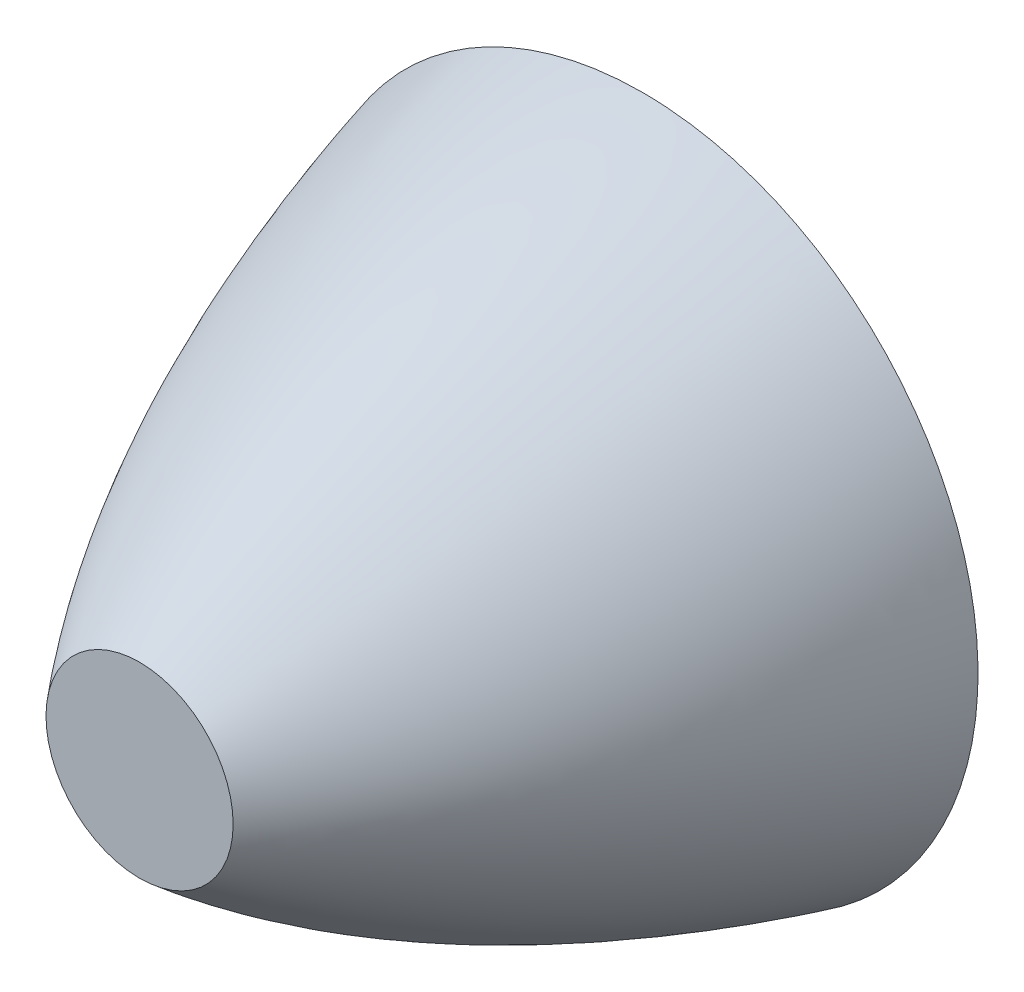
ISO-10303-21;
HEADER;
FILE_DESCRIPTION(('STEP AP214'),'2;1');
FILE_NAME('part.step','',(''),(''),'','','');
FILE_SCHEMA(('AUTOMOTIVE_DESIGN { 1 0 10303 214 1 1 1 1 }'));
ENDSEC;
DATA;
#1=APPLICATION_CONTEXT('core data for automotive mechanical design processes');
#2=APPLICATION_PROTOCOL_DEFINITION('international standard','automotive_design',2000,#1);
#3=PRODUCT_CONTEXT('',#1,'mechanical');
#4=PRODUCT('Part','Part','',(#3));
#5=PRODUCT_RELATED_PRODUCT_CATEGORY('part','',(#4));
#6=PRODUCT_DEFINITION_FORMATION('','',#4);
#7=PRODUCT_DEFINITION_CONTEXT('part definition',#1,'design');
#8=PRODUCT_DEFINITION('design','',#6,#7);
#9=PRODUCT_DEFINITION_SHAPE('','',#8);
#10=(LENGTH_UNIT() NAMED_UNIT(*) SI_UNIT(.MILLI.,.METRE.));
#11=(NAMED_UNIT(*) PLANE_ANGLE_UNIT() SI_UNIT($,.RADIAN.));
#12=(NAMED_UNIT(*) SI_UNIT($,.STERADIAN.) SOLID_ANGLE_UNIT());
#13=UNCERTAINTY_MEASURE_WITH_UNIT(LENGTH_MEASURE(1.E-05),#10,'distance_accuracy_value','');
#14=(GEOMETRIC_REPRESENTATION_CONTEXT(3) GLOBAL_UNCERTAINTY_ASSIGNED_CONTEXT((#13)) GLOBAL_UNIT_ASSIGNED_CONTEXT((#10,
#11,#12)) REPRESENTATION_CONTEXT('',''));
#15=CARTESIAN_POINT('',(0.,0.,0.));
#16=DIRECTION('',(0.,0.,1.));
#17=DIRECTION('',(1.,0.,0.));
#18=AXIS2_PLACEMENT_3D('',#15,#16,#17);
#19=CARTESIAN_POINT('',(0.,0.,75.));
#20=DIRECTION('',(0.,0.,1.));
#21=DIRECTION('',(1.,0.,0.));
#22=AXIS2_PLACEMENT_3D('',#19,#20,#21);
#23=PLANE('',#22);
#24=CARTESIAN_POINT('',(0.,13.95,75.));
#25=CARTESIAN_POINT('',(0.91302535900883,13.95,75.));
#26=CARTESIAN_POINT('',(2.73892759735863,13.7686142272891,75.));
#27=CARTESIAN_POINT('',(5.37335159956246,12.9725849281543,75.));
#28=CARTESIAN_POINT('',(7.79936233012814,11.6728116670155,75.));
#29=CARTESIAN_POINT('',(9.92862671172328,9.92862671172327,75.));
#30=CARTESIAN_POINT('',(11.6728116670155,7.79936233012814,75.));
#31=CARTESIAN_POINT('',(12.9725849281543,5.37335159956247,75.));
#32=CARTESIAN_POINT('',(13.7686142272891,2.73892759735863,75.));
#33=CARTESIAN_POINT('',(13.95,0.913025359008829,75.));
#34=CARTESIAN_POINT('',(13.95,-0.913025359008829,75.));
#35=CARTESIAN_POINT('',(13.7686142272891,-2.73892759735863,75.));
#36=CARTESIAN_POINT('',(12.9725849281543,-5.37335159956246,75.));
#37=CARTESIAN_POINT('',(11.6728116670155,-7.79936233012814,75.));
#38=CARTESIAN_POINT('',(9.92862671172328,-9.92862671172328,75.));
#39=CARTESIAN_POINT('',(7.79936233012814,-11.6728116670155,75.));
#40=CARTESIAN_POINT('',(5.37335159956247,-12.9725849281543,75.));
#41=CARTESIAN_POINT('',(2.73892759735863,-13.7686142272891,75.));
#42=CARTESIAN_POINT('',(0.913025359008826,-13.95,75.));
#43=CARTESIAN_POINT('',(-0.913025359008832,-13.95,75.));
#44=CARTESIAN_POINT('',(-2.73892759735863,-13.7686142272891,75.));
#45=CARTESIAN_POINT('',(-5.37335159956246,-12.9725849281543,75.));
#46=CARTESIAN_POINT('',(-7.79936233012814,-11.6728116670155,75.));
#47=CARTESIAN_POINT('',(-9.92862671172328,-9.92862671172328,75.));
#48=CARTESIAN_POINT('',(-11.6728116670155,-7.79936233012814,75.));
#49=CARTESIAN_POINT('',(-12.9725849281543,-5.37335159956246,75.));
#50=CARTESIAN_POINT('',(-13.7686142272891,-2.73892759735863,75.));
#51=CARTESIAN_POINT('',(-13.95,-0.913025359008827,75.));
#52=CARTESIAN_POINT('',(-13.95,0.913025359008831,75.));
#53=CARTESIAN_POINT('',(-13.7686142272891,2.73892759735863,75.));
#54=CARTESIAN_POINT('',(-12.9725849281543,5.37335159956247,75.));
#55=CARTESIAN_POINT('',(-11.6728116670155,7.79936233012814,75.));
#56=CARTESIAN_POINT('',(-9.92862671172327,9.92862671172327,75.));
#57=CARTESIAN_POINT('',(-7.79936233012814,11.6728116670155,75.));
#58=CARTESIAN_POINT('',(-5.37335159956247,12.9725849281543,75.));
#59=CARTESIAN_POINT('',(-2.73892759735864,13.7686142272891,75.));
#60=CARTESIAN_POINT('',(-0.913025359008828,13.95,75.));
#61=CARTESIAN_POINT('',(0.,13.95,75.));
#62=B_SPLINE_CURVE_WITH_KNOTS('',3,(#24,#25,#26,#27,#28,#29,#30,#31,#32,#33,#34,#35,#36,#37,#38,
#39,#40,#41,#42,#43,#44,#45,#46,#47,#48,#49,#50,#51,#52,#53,#54,#55,#56,#57,#58,#59,#60,#61),
.UNSPECIFIED.,.T.,.F.,(4,1,1,1,1,1,1,1,2,1,1,1,1,1,1,1,2,1,1,1,1,1,1,1,2,1,1,1,1,1,1,1,4),(0.,
0.03125,0.0625,0.09375,0.125,0.15625,0.1875,0.21875,0.25,0.28125,0.3125,0.34375,0.375,0.40625,
0.4375,0.46875,0.5,0.53125,0.5625,0.59375,0.625,0.65625,0.6875,0.71875,0.75,0.78125,0.8125,
0.84375,0.875,0.90625,0.9375,0.96875,1.),.UNSPECIFIED.);
#63=CARTESIAN_POINT('',(0.,13.95,75.));
#64=VERTEX_POINT('',#63);
#65=EDGE_CURVE('E9',#64,#64,#62,.F.);
#66=ORIENTED_EDGE('',*,*,#65,.T.);
#67=EDGE_LOOP('',(#66));
#68=FACE_BOUND('',#67,.T.);
#69=ADVANCED_FACE('F14',(#68),#23,.T.);
#70=CARTESIAN_POINT('',(0.,0.,0.));
#71=DIRECTION('',(0.,0.,1.));
#72=DIRECTION('',(1.,0.,0.));
#73=AXIS2_PLACEMENT_3D('',#70,#71,#72);
#74=PLANE('',#73);
#75=CARTESIAN_POINT('',(0.,50.,0.));
#76=CARTESIAN_POINT('',(-3.27249232619652,50.,0.));
#77=CARTESIAN_POINT('',(-9.81739881748334,49.3555679668692,0.));
#78=CARTESIAN_POINT('',(-19.2575569405846,46.4918078630419,0.));
#79=CARTESIAN_POINT('',(-27.9576361956054,41.8415808724706,0.));
#80=CARTESIAN_POINT('',(-35.5833109403082,35.5833109403082,0.));
#81=CARTESIAN_POINT('',(-41.8415808724706,27.9576361956053,0.));
#82=CARTESIAN_POINT('',(-46.491807863042,19.2575569405848,0.));
#83=CARTESIAN_POINT('',(-49.3555679668691,9.8173988174832,0.));
#84=CARTESIAN_POINT('',(-50.,3.27249232619653,0.));
#85=CARTESIAN_POINT('',(-50.,-3.27249232619652,0.));
#86=CARTESIAN_POINT('',(-49.3555679668692,-9.81739881748326,0.));
#87=CARTESIAN_POINT('',(-46.491807863042,-19.2575569405846,0.));
#88=CARTESIAN_POINT('',(-41.8415808724706,-27.9576361956054,0.));
#89=CARTESIAN_POINT('',(-35.5833109403083,-35.5833109403082,0.));
#90=CARTESIAN_POINT('',(-27.9576361956053,-41.8415808724706,0.));
#91=CARTESIAN_POINT('',(-19.2575569405848,-46.4918078630421,0.));
#92=CARTESIAN_POINT('',(-9.81739881748319,-49.355567966869,0.));
#93=CARTESIAN_POINT('',(-3.27249232619653,-50.,0.));
#94=CARTESIAN_POINT('',(3.27249232619651,-50.,0.));
#95=CARTESIAN_POINT('',(9.81739881748326,-49.3555679668691,0.));
#96=CARTESIAN_POINT('',(19.2575569405847,-46.4918078630421,0.));
#97=CARTESIAN_POINT('',(27.9576361956053,-41.8415808724706,0.));
#98=CARTESIAN_POINT('',(35.5833109403083,-35.5833109403082,0.));
#99=CARTESIAN_POINT('',(41.8415808724705,-27.9576361956054,0.));
#100=CARTESIAN_POINT('',(46.4918078630421,-19.2575569405848,0.));
#101=CARTESIAN_POINT('',(49.355567966869,-9.8173988174832,0.));
#102=CARTESIAN_POINT('',(50.,-3.27249232619652,0.));
#103=CARTESIAN_POINT('',(50.,3.27249232619652,0.));
#104=CARTESIAN_POINT('',(49.3555679668692,9.8173988174833,0.));
#105=CARTESIAN_POINT('',(46.491807863042,19.2575569405846,0.));
#106=CARTESIAN_POINT('',(41.8415808724707,27.9576361956054,0.));
#107=CARTESIAN_POINT('',(35.5833109403082,35.5833109403083,0.));
#108=CARTESIAN_POINT('',(27.9576361956054,41.8415808724706,0.));
#109=CARTESIAN_POINT('',(19.2575569405847,46.4918078630421,0.));
#110=CARTESIAN_POINT('',(9.81739881748319,49.355567966869,0.));
#111=CARTESIAN_POINT('',(3.27249232619653,50.,0.));
#112=CARTESIAN_POINT('',(0.,50.,0.));
#113=B_SPLINE_CURVE_WITH_KNOTS('',3,(#75,#76,#77,#78,#79,#80,#81,#82,#83,#84,#85,#86,#87,#88,
#89,#90,#91,#92,#93,#94,#95,#96,#97,#98,#99,#100,#101,#102,#103,#104,#105,#106,#107,#108,#109,
#110,#111,#112),.UNSPECIFIED.,.T.,.F.,(4,1,1,1,1,1,1,1,2,1,1,1,1,1,1,1,2,1,1,1,1,1,1,1,2,1,1,1,
1,1,1,1,4),(0.,0.03125,0.0625,0.09375,0.125,0.15625,0.1875,0.21875,0.25,0.28125,0.3125,0.34375,
0.375,0.40625,0.4375,0.46875,0.5,0.53125,0.5625,0.59375,0.625,0.65625,0.6875,0.71875,0.75,
0.78125,0.8125,0.84375,0.875,0.90625,0.9375,0.96875,1.),.UNSPECIFIED.);
#114=CARTESIAN_POINT('',(0.,50.,0.));
#115=VERTEX_POINT('',#114);
#116=EDGE_CURVE('E23',#115,#115,#113,.T.);
#117=ORIENTED_EDGE('',*,*,#116,.F.);
#118=EDGE_LOOP('',(#117));
#119=FACE_BOUND('',#118,.T.);
#120=ADVANCED_FACE('F49',(#119),#74,.F.);
#121=CARTESIAN_POINT('',(0.,50.,0.));
#122=CARTESIAN_POINT('',(0.,44.4643359863118,28.068168317841));
#123=CARTESIAN_POINT('',(0.,32.4476693196452,53.0681683178409));
#124=CARTESIAN_POINT('',(0.,13.95,75.));
#125=CARTESIAN_POINT('',(-3.27249232619652,50.,0.));
#126=CARTESIAN_POINT('',(-2.48600333713396,44.4643359863118,28.068168317841));
#127=CARTESIAN_POINT('',(-1.6995143480714,32.4476693196452,53.0681683178409));
#128=CARTESIAN_POINT('',(-0.913025359008828,13.95,75.));
#129=CARTESIAN_POINT('',(-9.81739881748334,49.3555679668692,0.));
#130=CARTESIAN_POINT('',(-7.65130661791002,43.7717213737487,28.0635445711323));
#131=CARTESIAN_POINT('',(-5.29181621120178,31.9094034605554,53.0635445711323));
#132=CARTESIAN_POINT('',(-2.73892759735864,13.7686142272891,75.));
#133=CARTESIAN_POINT('',(-19.2575569405846,46.4918078630419,0.));
#134=CARTESIAN_POINT('',(-15.5481299774681,40.8377123730898,28.0462055209748));
#135=CARTESIAN_POINT('',(-10.9200615304607,29.6646380614605,53.0462055209748));
#136=CARTESIAN_POINT('',(-5.37335159956247,12.9725849281543,75.));
#137=CARTESIAN_POINT('',(-27.9576361956054,41.8415808724706,0.));
#138=CARTESIAN_POINT('',(-23.1721936451288,36.2410137945749,28.0219308507543));
#139=CARTESIAN_POINT('',(-16.452769023303,26.1847573927566,53.0219308507544));
#140=CARTESIAN_POINT('',(-7.79936233012814,11.6728116670155,75.));
#141=CARTESIAN_POINT('',(-35.5833109403082,35.5833109403082,0.));
#142=CARTESIAN_POINT('',(-30.1261208449384,30.2722508572692,27.9941883705023));
#143=CARTESIAN_POINT('',(-21.5745594354101,21.7206894477408,52.9941883705024));
#144=CARTESIAN_POINT('',(-9.92862671172327,9.92862671172327,75.));
#145=CARTESIAN_POINT('',(-41.8415808724706,27.9576361956053,0.));
#146=CARTESIAN_POINT('',(-36.0400850276203,23.2635249028354,27.9664458902504));
#147=CARTESIAN_POINT('',(-25.9838286258019,16.5441002810097,52.9664458902504));
#148=CARTESIAN_POINT('',(-11.6728116670155,7.79936233012814,75.));
#149=CARTESIAN_POINT('',(-46.491807863042,19.2575569405848,0.));
#150=CARTESIAN_POINT('',(-40.588834695839,15.5915123248788,27.94217122003));
#151=CARTESIAN_POINT('',(-29.4157603842098,10.9634438778714,52.94217122003));
#152=CARTESIAN_POINT('',(-12.9725849281543,5.37335159956247,75.));
#153=CARTESIAN_POINT('',(-49.3555679668691,9.8173988174832,0.));
#154=CARTESIAN_POINT('',(-43.4885944748579,7.66043974368059,27.9248321698725));
#155=CARTESIAN_POINT('',(-31.6262765616646,5.3009493369724,52.9248321698725));
#156=CARTESIAN_POINT('',(-13.7686142272891,2.73892759735863,75.));
#157=CARTESIAN_POINT('',(-50.,3.27249232619653,0.));
#158=CARTESIAN_POINT('',(-44.1720759616504,2.48600333713396,27.9202084231638));
#159=CARTESIAN_POINT('',(-32.1554092949837,1.6995143480714,52.9202084231638));
#160=CARTESIAN_POINT('',(-13.95,0.913025359008831,75.));
#161=CARTESIAN_POINT('',(-50.,-3.27249232619652,0.));
#162=CARTESIAN_POINT('',(-44.1720759616504,-2.48600333713396,27.9202084231638));
#163=CARTESIAN_POINT('',(-32.1554092949837,-1.69951434807139,52.9202084231638));
#164=CARTESIAN_POINT('',(-13.95,-0.913025359008827,75.));
#165=CARTESIAN_POINT('',(-49.3555679668692,-9.81739881748326,0.));
#166=CARTESIAN_POINT('',(-43.4885944748579,-7.66043974368063,27.9248321698725));
#167=CARTESIAN_POINT('',(-31.6262765616646,-5.30094933697242,52.9248321698725));
#168=CARTESIAN_POINT('',(-13.7686142272891,-2.73892759735863,75.));
#169=CARTESIAN_POINT('',(-46.491807863042,-19.2575569405846,0.));
#170=CARTESIAN_POINT('',(-40.588834695839,-15.5915123248788,27.94217122003));
#171=CARTESIAN_POINT('',(-29.4157603842098,-10.9634438778714,52.94217122003));
#172=CARTESIAN_POINT('',(-12.9725849281543,-5.37335159956246,75.));
#173=CARTESIAN_POINT('',(-41.8415808724706,-27.9576361956054,0.));
#174=CARTESIAN_POINT('',(-36.0400850276202,-23.2635249028354,27.9664458902504));
#175=CARTESIAN_POINT('',(-25.9838286258019,-16.5441002810097,52.9664458902504));
#176=CARTESIAN_POINT('',(-11.6728116670155,-7.79936233012814,75.));
#177=CARTESIAN_POINT('',(-35.5833109403083,-35.5833109403082,0.));
#178=CARTESIAN_POINT('',(-30.1261208449385,-30.2722508572692,27.9941883705024));
#179=CARTESIAN_POINT('',(-21.5745594354101,-21.7206894477408,52.9941883705024));
#180=CARTESIAN_POINT('',(-9.92862671172328,-9.92862671172328,75.));
#181=CARTESIAN_POINT('',(-27.9576361956053,-41.8415808724706,0.));
#182=CARTESIAN_POINT('',(-23.1721936451287,-36.2410137945749,28.0219308507543));
#183=CARTESIAN_POINT('',(-16.452769023303,-26.1847573927566,53.0219308507544));
#184=CARTESIAN_POINT('',(-7.79936233012814,-11.6728116670155,75.));
#185=CARTESIAN_POINT('',(-19.2575569405848,-46.4918078630421,0.));
#186=CARTESIAN_POINT('',(-15.5481299774681,-40.8377123730899,28.0462055209748));
#187=CARTESIAN_POINT('',(-10.9200615304607,-29.6646380614605,53.0462055209748));
#188=CARTESIAN_POINT('',(-5.37335159956246,-12.9725849281543,75.));
#189=CARTESIAN_POINT('',(-9.81739881748319,-49.355567966869,0.));
#190=CARTESIAN_POINT('',(-7.65130661790991,-43.7717213737486,28.0635445711323));
#191=CARTESIAN_POINT('',(-5.29181621120172,-31.9094034605554,53.0635445711323));
#192=CARTESIAN_POINT('',(-2.73892759735863,-13.7686142272891,75.));
#193=CARTESIAN_POINT('',(-3.27249232619653,-50.,0.));
#194=CARTESIAN_POINT('',(-2.48600333713396,-44.4643359863118,28.068168317841));
#195=CARTESIAN_POINT('',(-1.6995143480714,-32.4476693196452,53.0681683178409));
#196=CARTESIAN_POINT('',(-0.913025359008832,-13.95,75.));
#197=CARTESIAN_POINT('',(3.27249232619651,-50.,0.));
#198=CARTESIAN_POINT('',(2.48600333713396,-44.4643359863118,28.068168317841));
#199=CARTESIAN_POINT('',(1.6995143480714,-32.4476693196452,53.0681683178409));
#200=CARTESIAN_POINT('',(0.913025359008826,-13.95,75.));
#201=CARTESIAN_POINT('',(9.81739881748326,-49.3555679668691,0.));
#202=CARTESIAN_POINT('',(7.65130661790997,-43.7717213737487,28.0635445711323));
#203=CARTESIAN_POINT('',(5.29181621120176,-31.9094034605554,53.0635445711323));
#204=CARTESIAN_POINT('',(2.73892759735863,-13.7686142272891,75.));
#205=CARTESIAN_POINT('',(19.2575569405847,-46.4918078630421,0.));
#206=CARTESIAN_POINT('',(15.5481299774681,-40.8377123730898,28.0462055209748));
#207=CARTESIAN_POINT('',(10.9200615304607,-29.6646380614605,53.0462055209748));
#208=CARTESIAN_POINT('',(5.37335159956247,-12.9725849281543,75.));
#209=CARTESIAN_POINT('',(27.9576361956053,-41.8415808724706,0.));
#210=CARTESIAN_POINT('',(23.1721936451287,-36.2410137945749,28.0219308507543));
#211=CARTESIAN_POINT('',(16.452769023303,-26.1847573927566,53.0219308507544));
#212=CARTESIAN_POINT('',(7.79936233012814,-11.6728116670155,75.));
#213=CARTESIAN_POINT('',(35.5833109403083,-35.5833109403082,0.));
#214=CARTESIAN_POINT('',(30.1261208449385,-30.2722508572692,27.9941883705024));
#215=CARTESIAN_POINT('',(21.5745594354102,-21.7206894477408,52.9941883705024));
#216=CARTESIAN_POINT('',(9.92862671172328,-9.92862671172328,75.));
#217=CARTESIAN_POINT('',(41.8415808724705,-27.9576361956054,0.));
#218=CARTESIAN_POINT('',(36.0400850276202,-23.2635249028354,27.9664458902504));
#219=CARTESIAN_POINT('',(25.9838286258018,-16.5441002810097,52.9664458902504));
#220=CARTESIAN_POINT('',(11.6728116670155,-7.79936233012814,75.));
#221=CARTESIAN_POINT('',(46.4918078630421,-19.2575569405848,0.));
#222=CARTESIAN_POINT('',(40.5888346958391,-15.5915123248788,27.94217122003));
#223=CARTESIAN_POINT('',(29.4157603842099,-10.9634438778714,52.94217122003));
#224=CARTESIAN_POINT('',(12.9725849281543,-5.37335159956246,75.));
#225=CARTESIAN_POINT('',(49.355567966869,-9.8173988174832,0.));
#226=CARTESIAN_POINT('',(43.4885944748579,-7.66043974368059,27.9248321698725));
#227=CARTESIAN_POINT('',(31.6262765616646,-5.3009493369724,52.9248321698725));
#228=CARTESIAN_POINT('',(13.7686142272891,-2.73892759735863,75.));
#229=CARTESIAN_POINT('',(50.,-3.27249232619652,0.));
#230=CARTESIAN_POINT('',(44.1720759616504,-2.48600333713396,27.9202084231638));
#231=CARTESIAN_POINT('',(32.1554092949837,-1.6995143480714,52.9202084231638));
#232=CARTESIAN_POINT('',(13.95,-0.913025359008829,75.));
#233=CARTESIAN_POINT('',(50.,3.27249232619652,0.));
#234=CARTESIAN_POINT('',(44.1720759616504,2.48600333713396,27.9202084231638));
#235=CARTESIAN_POINT('',(32.1554092949837,1.6995143480714,52.9202084231638));
#236=CARTESIAN_POINT('',(13.95,0.913025359008829,75.));
#237=CARTESIAN_POINT('',(49.3555679668692,9.8173988174833,0.));
#238=CARTESIAN_POINT('',(43.4885944748579,7.66043974368066,27.9248321698725));
#239=CARTESIAN_POINT('',(31.6262765616646,5.30094933697244,52.9248321698725));
#240=CARTESIAN_POINT('',(13.7686142272891,2.73892759735863,75.));
#241=CARTESIAN_POINT('',(46.491807863042,19.2575569405846,0.));
#242=CARTESIAN_POINT('',(40.588834695839,15.5915123248788,27.94217122003));
#243=CARTESIAN_POINT('',(29.4157603842098,10.9634438778714,52.94217122003));
#244=CARTESIAN_POINT('',(12.9725849281543,5.37335159956247,75.));
#245=CARTESIAN_POINT('',(41.8415808724707,27.9576361956054,0.));
#246=CARTESIAN_POINT('',(36.0400850276203,23.2635249028354,27.9664458902504));
#247=CARTESIAN_POINT('',(25.9838286258019,16.5441002810097,52.9664458902504));
#248=CARTESIAN_POINT('',(11.6728116670155,7.79936233012814,75.));
#249=CARTESIAN_POINT('',(35.5833109403082,35.5833109403083,0.));
#250=CARTESIAN_POINT('',(30.1261208449384,30.2722508572692,27.9941883705024));
#251=CARTESIAN_POINT('',(21.5745594354101,21.7206894477409,52.9941883705024));
#252=CARTESIAN_POINT('',(9.92862671172328,9.92862671172327,75.));
#253=CARTESIAN_POINT('',(27.9576361956054,41.8415808724706,0.));
#254=CARTESIAN_POINT('',(23.1721936451287,36.2410137945749,28.0219308507543));
#255=CARTESIAN_POINT('',(16.452769023303,26.1847573927566,53.0219308507544));
#256=CARTESIAN_POINT('',(7.79936233012814,11.6728116670155,75.));
#257=CARTESIAN_POINT('',(19.2575569405847,46.4918078630421,0.));
#258=CARTESIAN_POINT('',(15.5481299774681,40.8377123730899,28.0462055209748));
#259=CARTESIAN_POINT('',(10.9200615304607,29.6646380614606,53.0462055209748));
#260=CARTESIAN_POINT('',(5.37335159956246,12.9725849281543,75.));
#261=CARTESIAN_POINT('',(9.81739881748319,49.355567966869,0.));
#262=CARTESIAN_POINT('',(7.65130661790991,43.7717213737486,28.0635445711323));
#263=CARTESIAN_POINT('',(5.29181621120172,31.9094034605554,53.0635445711323));
#264=CARTESIAN_POINT('',(2.73892759735863,13.7686142272891,75.));
#265=CARTESIAN_POINT('',(3.27249232619653,50.,0.));
#266=CARTESIAN_POINT('',(2.48600333713396,44.4643359863118,28.068168317841));
#267=CARTESIAN_POINT('',(1.6995143480714,32.4476693196452,53.0681683178409));
#268=CARTESIAN_POINT('',(0.91302535900883,13.95,75.));
#269=CARTESIAN_POINT('',(0.,50.,0.));
#270=CARTESIAN_POINT('',(0.,44.4643359863118,28.068168317841));
#271=CARTESIAN_POINT('',(0.,32.4476693196452,53.0681683178409));
#272=CARTESIAN_POINT('',(0.,13.95,75.));
#273=B_SPLINE_SURFACE_WITH_KNOTS('',3,3,((#121,#122,#123,#124),(#125,#126,#127,#128),(#129,#130,
#131,#132),(#133,#134,#135,#136),(#137,#138,#139,#140),(#141,#142,#143,#144),(#145,#146,#147,
#148),(#149,#150,#151,#152),(#153,#154,#155,#156),(#157,#158,#159,#160),(#161,#162,#163,#164),
(#165,#166,#167,#168),(#169,#170,#171,#172),(#173,#174,#175,#176),(#177,#178,#179,#180),(#181,
#182,#183,#184),(#185,#186,#187,#188),(#189,#190,#191,#192),(#193,#194,#195,#196),(#197,#198,
#199,#200),(#201,#202,#203,#204),(#205,#206,#207,#208),(#209,#210,#211,#212),(#213,#214,#215,
#216),(#217,#218,#219,#220),(#221,#222,#223,#224),(#225,#226,#227,#228),(#229,#230,#231,#232),
(#233,#234,#235,#236),(#237,#238,#239,#240),(#241,#242,#243,#244),(#245,#246,#247,#248),(#249,
#250,#251,#252),(#253,#254,#255,#256),(#257,#258,#259,#260),(#261,#262,#263,#264),(#265,#266,
#267,#268),(#269,#270,#271,#272)),.UNSPECIFIED.,.T.,.F.,.F.,(4,1,1,1,1,1,1,1,2,1,1,1,1,1,1,1,2,
1,1,1,1,1,1,1,2,1,1,1,1,1,1,1,4),(4,4),(0.,0.03125,0.0625,0.09375,0.125,0.15625,0.1875,0.21875,
0.25,0.28125,0.3125,0.34375,0.375,0.40625,0.4375,0.46875,0.5,0.53125,0.5625,0.59375,0.625,
0.65625,0.6875,0.71875,0.75,0.78125,0.8125,0.84375,0.875,0.90625,0.9375,0.96875,1.),(0.,1.),.UNSPECIFIED.);
#274=ORIENTED_EDGE('',*,*,#116,.T.);
#275=EDGE_LOOP('',(#274));
#276=FACE_BOUND('',#275,.T.);
#277=ORIENTED_EDGE('',*,*,#65,.F.);
#278=EDGE_LOOP('',(#277));
#279=FACE_BOUND('',#278,.T.);
#280=ADVANCED_FACE('F30',(#276,#279),#273,.T.);
#281=CLOSED_SHELL('',(#69,#120,#280));
#282=MANIFOLD_SOLID_BREP('B1',#281);
#283=ADVANCED_BREP_SHAPE_REPRESENTATION('',(#18,#282),#14);
#284=SHAPE_DEFINITION_REPRESENTATION(#9,#283);
ENDSEC;
END-ISO-10303-21;
